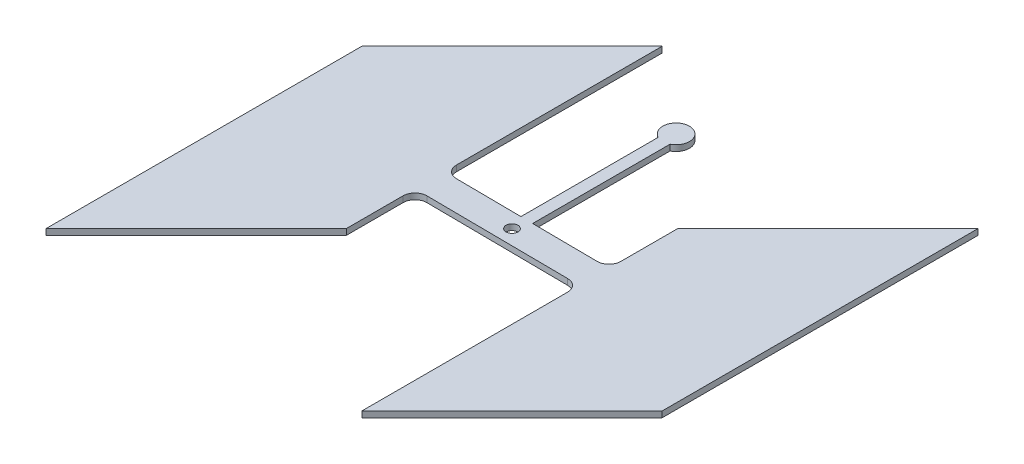
ISO-10303-21;
HEADER;
FILE_DESCRIPTION(('STEP AP214'),'2;1');
FILE_NAME('part.step','',(''),(''),'','','');
FILE_SCHEMA(('AUTOMOTIVE_DESIGN { 1 0 10303 214 1 1 1 1 }'));
ENDSEC;
DATA;
#1=APPLICATION_CONTEXT('core data for automotive mechanical design processes');
#2=APPLICATION_PROTOCOL_DEFINITION('international standard','automotive_design',2000,#1);
#3=PRODUCT_CONTEXT('',#1,'mechanical');
#4=PRODUCT('Part','Part','',(#3));
#5=PRODUCT_RELATED_PRODUCT_CATEGORY('part','',(#4));
#6=PRODUCT_DEFINITION_FORMATION('','',#4);
#7=PRODUCT_DEFINITION_CONTEXT('part definition',#1,'design');
#8=PRODUCT_DEFINITION('design','',#6,#7);
#9=PRODUCT_DEFINITION_SHAPE('','',#8);
#10=(LENGTH_UNIT() NAMED_UNIT(*) SI_UNIT(.MILLI.,.METRE.));
#11=(NAMED_UNIT(*) PLANE_ANGLE_UNIT() SI_UNIT($,.RADIAN.));
#12=(NAMED_UNIT(*) SI_UNIT($,.STERADIAN.) SOLID_ANGLE_UNIT());
#13=UNCERTAINTY_MEASURE_WITH_UNIT(LENGTH_MEASURE(1.E-05),#10,'distance_accuracy_value','');
#14=(GEOMETRIC_REPRESENTATION_CONTEXT(3) GLOBAL_UNCERTAINTY_ASSIGNED_CONTEXT((#13)) GLOBAL_UNIT_ASSIGNED_CONTEXT((#10,
#11,#12)) REPRESENTATION_CONTEXT('',''));
#15=CARTESIAN_POINT('',(0.,0.,0.));
#16=DIRECTION('',(0.,0.,1.));
#17=DIRECTION('',(1.,0.,0.));
#18=AXIS2_PLACEMENT_3D('',#15,#16,#17);
#19=CARTESIAN_POINT('',(-499.999999999996,12.7,4.16333634234426E-12));
#20=DIRECTION('',(1.,0.,0.));
#21=DIRECTION('',(0.,0.,-1.));
#22=AXIS2_PLACEMENT_3D('',#19,#20,#21);
#23=PLANE('',#22);
#24=DIRECTION('',(0.,0.,1.));
#25=VECTOR('',#24,1.);
#26=CARTESIAN_POINT('',(-499.999999999996,0.,4.16333634234426E-12));
#27=LINE('',#26,#25);
#28=CARTESIAN_POINT('',(-499.999999999997,0.,-177.7930007804));
#29=VERTEX_POINT('',#28);
#30=CARTESIAN_POINT('',(-499.999999999992,0.,500.00000000001));
#31=VERTEX_POINT('',#30);
#32=EDGE_CURVE('E271',#29,#31,#27,.T.);
#33=ORIENTED_EDGE('',*,*,#32,.T.);
#34=DIRECTION('',(0.,-1.,0.));
#35=VECTOR('',#34,1.);
#36=CARTESIAN_POINT('',(-499.999999999992,12.7,500.00000000001));
#37=LINE('',#36,#35);
#38=CARTESIAN_POINT('',(-499.999999999992,12.7,500.00000000001));
#39=VERTEX_POINT('',#38);
#40=EDGE_CURVE('E11',#39,#31,#37,.T.);
#41=ORIENTED_EDGE('',*,*,#40,.F.);
#42=DIRECTION('',(0.,0.,1.));
#43=VECTOR('',#42,1.);
#44=CARTESIAN_POINT('',(-499.999999999996,12.7,4.16333634234426E-12));
#45=LINE('',#44,#43);
#46=CARTESIAN_POINT('',(-499.999999999997,12.7,-177.7930007804));
#47=VERTEX_POINT('',#46);
#48=EDGE_CURVE('E211',#47,#39,#45,.T.);
#49=ORIENTED_EDGE('',*,*,#48,.F.);
#50=DIRECTION('',(0.,-1.,0.));
#51=VECTOR('',#50,1.);
#52=CARTESIAN_POINT('',(-499.999999999997,12.7,-177.7930007804));
#53=LINE('',#52,#51);
#54=EDGE_CURVE('E224',#47,#29,#53,.T.);
#55=ORIENTED_EDGE('',*,*,#54,.T.);
#56=EDGE_LOOP('',(#33,#41,#49,#55));
#57=FACE_BOUND('',#56,.T.);
#58=ADVANCED_FACE('F37',(#57),#23,.F.);
#59=CARTESIAN_POINT('',(2.74766180269664E-12,12.7,2.74766180269657E-12));
#60=DIRECTION('',(-0.707106781186557,0.,-0.707106781186538));
#61=DIRECTION('',(-0.707106781186538,0.,0.707106781186557));
#62=AXIS2_PLACEMENT_3D('',#59,#60,#61);
#63=PLANE('',#62);
#64=DIRECTION('',(0.707106781186538,0.,-0.707106781186557));
#65=VECTOR('',#64,1.);
#66=CARTESIAN_POINT('',(2.74766180269664E-12,0.,2.74766180269657E-12));
#67=LINE('',#66,#65);
#68=CARTESIAN_POINT('',(-177.793000780398,0.,177.793000780408));
#69=VERTEX_POINT('',#68);
#70=EDGE_CURVE('E266',#31,#69,#67,.T.);
#71=ORIENTED_EDGE('',*,*,#70,.T.);
#72=DIRECTION('',(0.,-1.,0.));
#73=VECTOR('',#72,1.);
#74=CARTESIAN_POINT('',(-177.793000780398,12.7,177.793000780408));
#75=LINE('',#74,#73);
#76=CARTESIAN_POINT('',(-177.793000780398,12.7,177.793000780408));
#77=VERTEX_POINT('',#76);
#78=EDGE_CURVE('E45',#77,#69,#75,.T.);
#79=ORIENTED_EDGE('',*,*,#78,.F.);
#80=DIRECTION('',(0.707106781186538,0.,-0.707106781186557));
#81=VECTOR('',#80,1.);
#82=CARTESIAN_POINT('',(2.74766180269664E-12,12.7,2.74766180269657E-12));
#83=LINE('',#82,#81);
#84=EDGE_CURVE('E128',#39,#77,#83,.T.);
#85=ORIENTED_EDGE('',*,*,#84,.F.);
#86=ORIENTED_EDGE('',*,*,#40,.T.);
#87=EDGE_LOOP('',(#71,#79,#85,#86));
#88=FACE_BOUND('',#87,.T.);
#89=ADVANCED_FACE('F267',(#88),#63,.F.);
#90=CARTESIAN_POINT('',(-177.793000780398,12.7,0.));
#91=DIRECTION('',(1.,0.,0.));
#92=DIRECTION('',(0.,0.,-1.));
#93=AXIS2_PLACEMENT_3D('',#90,#91,#92);
#94=PLANE('',#93);
#95=DIRECTION('',(0.,0.,1.));
#96=VECTOR('',#95,1.);
#97=CARTESIAN_POINT('',(-177.793000780398,0.,0.));
#98=LINE('',#97,#96);
#99=CARTESIAN_POINT('',(-177.793000780398,0.,55.7987661759797));
#100=VERTEX_POINT('',#99);
#101=EDGE_CURVE('E264',#100,#69,#98,.T.);
#102=ORIENTED_EDGE('',*,*,#101,.F.);
#103=DIRECTION('',(0.,-1.,0.));
#104=VECTOR('',#103,1.);
#105=CARTESIAN_POINT('',(-177.793000780398,12.7,55.7987661759797));
#106=LINE('',#105,#104);
#107=CARTESIAN_POINT('',(-177.793000780398,12.7,55.7987661759797));
#108=VERTEX_POINT('',#107);
#109=EDGE_CURVE('E259',#108,#100,#106,.T.);
#110=ORIENTED_EDGE('',*,*,#109,.F.);
#111=DIRECTION('',(0.,0.,1.));
#112=VECTOR('',#111,1.);
#113=CARTESIAN_POINT('',(-177.793000780398,12.7,0.));
#114=LINE('',#113,#112);
#115=EDGE_CURVE('E200',#108,#77,#114,.T.);
#116=ORIENTED_EDGE('',*,*,#115,.T.);
#117=ORIENTED_EDGE('',*,*,#78,.T.);
#118=EDGE_LOOP('',(#102,#110,#116,#117));
#119=FACE_BOUND('',#118,.T.);
#120=ADVANCED_FACE('F262',(#119),#94,.T.);
#121=CARTESIAN_POINT('',(-152.393000780439,12.7,55.7987661759797));
#122=DIRECTION('',(0.,-1.,0.));
#123=DIRECTION('',(0.,0.,-1.));
#124=AXIS2_PLACEMENT_3D('',#121,#122,#123);
#125=CYLINDRICAL_SURFACE('',#124,25.4);
#126=CARTESIAN_POINT('',(-152.393000780439,0.,55.7987661759797));
#127=DIRECTION('',(0.,1.,0.));
#128=DIRECTION('',(0.,0.,1.));
#129=AXIS2_PLACEMENT_3D('',#126,#127,#128);
#130=CIRCLE('',#129,25.4);
#131=CARTESIAN_POINT('',(-152.16762700973,0.,30.3997660644895));
#132=VERTEX_POINT('',#131);
#133=EDGE_CURVE('E276',#132,#100,#130,.T.);
#134=ORIENTED_EDGE('',*,*,#133,.F.);
#135=DIRECTION('',(0.,-1.,0.));
#136=VECTOR('',#135,1.);
#137=CARTESIAN_POINT('',(-152.16762700973,12.7,30.3997660644895));
#138=LINE('',#137,#136);
#139=CARTESIAN_POINT('',(-152.16762700973,12.7,30.3997660644895));
#140=VERTEX_POINT('',#139);
#141=EDGE_CURVE('E257',#140,#132,#138,.T.);
#142=ORIENTED_EDGE('',*,*,#141,.F.);
#143=CARTESIAN_POINT('',(-152.393000780439,12.7,55.7987661759797));
#144=DIRECTION('',(0.,1.,0.));
#145=DIRECTION('',(0.,0.,1.));
#146=AXIS2_PLACEMENT_3D('',#143,#144,#145);
#147=CIRCLE('',#146,25.4);
#148=EDGE_CURVE('E206',#140,#108,#147,.T.);
#149=ORIENTED_EDGE('',*,*,#148,.T.);
#150=ORIENTED_EDGE('',*,*,#109,.T.);
#151=EDGE_LOOP('',(#134,#142,#149,#150));
#152=FACE_BOUND('',#151,.T.);
#153=ADVANCED_FACE('F377',(#152),#125,.F.);
#154=CARTESIAN_POINT('',(-0.281706123395104,12.7,31.7475003279495));
#155=DIRECTION('',(0.00887298309880992,0.,-0.999960634310635));
#156=DIRECTION('',(-0.999960634310635,0.,-0.00887298309880992));
#157=AXIS2_PLACEMENT_3D('',#154,#155,#156);
#158=PLANE('',#157);
#159=DIRECTION('',(0.999960634310635,0.,0.00887298309880992));
#160=VECTOR('',#159,1.);
#161=CARTESIAN_POINT('',(-0.281706123395104,0.,31.7475003279495));
#162=LINE('',#161,#160);
#163=CARTESIAN_POINT('',(152.618374551146,0.,33.1042335683207));
#164=VERTEX_POINT('',#163);
#165=EDGE_CURVE('E278',#132,#164,#162,.T.);
#166=ORIENTED_EDGE('',*,*,#165,.T.);
#167=DIRECTION('',(0.,-1.,0.));
#168=VECTOR('',#167,1.);
#169=CARTESIAN_POINT('',(152.618374551146,12.7,33.1042335683207));
#170=LINE('',#169,#168);
#171=CARTESIAN_POINT('',(152.618374551146,12.7,33.1042335683207));
#172=VERTEX_POINT('',#171);
#173=EDGE_CURVE('E254',#172,#164,#170,.T.);
#174=ORIENTED_EDGE('',*,*,#173,.F.);
#175=DIRECTION('',(0.999960634310635,0.,0.00887298309880992));
#176=VECTOR('',#175,1.);
#177=CARTESIAN_POINT('',(-0.281706123395104,12.7,31.7475003279495));
#178=LINE('',#177,#176);
#179=EDGE_CURVE('E210',#140,#172,#178,.T.);
#180=ORIENTED_EDGE('',*,*,#179,.F.);
#181=ORIENTED_EDGE('',*,*,#141,.T.);
#182=EDGE_LOOP('',(#166,#174,#180,#181));
#183=FACE_BOUND('',#182,.T.);
#184=ADVANCED_FACE('F312',(#183),#158,.F.);
#185=CARTESIAN_POINT('',(152.393000780437,12.7,58.5032336798109));
#186=DIRECTION('',(0.,-1.,0.));
#187=DIRECTION('',(0.,0.,-1.));
#188=AXIS2_PLACEMENT_3D('',#185,#186,#187);
#189=CYLINDRICAL_SURFACE('',#188,25.4);
#190=CARTESIAN_POINT('',(152.393000780437,0.,58.5032336798109));
#191=DIRECTION('',(0.,1.,0.));
#192=DIRECTION('',(0.,0.,1.));
#193=AXIS2_PLACEMENT_3D('',#190,#191,#192);
#194=CIRCLE('',#193,25.4);
#195=CARTESIAN_POINT('',(177.793000780437,0.,58.5032336798109));
#196=VERTEX_POINT('',#195);
#197=EDGE_CURVE('E308',#164,#196,#194,.F.);
#198=ORIENTED_EDGE('',*,*,#197,.T.);
#199=DIRECTION('',(0.,-1.,0.));
#200=VECTOR('',#199,1.);
#201=CARTESIAN_POINT('',(177.793000780437,12.7,58.5032336798109));
#202=LINE('',#201,#200);
#203=CARTESIAN_POINT('',(177.793000780437,12.7,58.5032336798109));
#204=VERTEX_POINT('',#203);
#205=EDGE_CURVE('E251',#204,#196,#202,.T.);
#206=ORIENTED_EDGE('',*,*,#205,.F.);
#207=CARTESIAN_POINT('',(152.393000780437,12.7,58.5032336798109));
#208=DIRECTION('',(0.,1.,0.));
#209=DIRECTION('',(0.,0.,1.));
#210=AXIS2_PLACEMENT_3D('',#207,#208,#209);
#211=CIRCLE('',#210,25.4);
#212=EDGE_CURVE('E319',#172,#204,#211,.F.);
#213=ORIENTED_EDGE('',*,*,#212,.F.);
#214=ORIENTED_EDGE('',*,*,#173,.T.);
#215=EDGE_LOOP('',(#198,#206,#213,#214));
#216=FACE_BOUND('',#215,.T.);
#217=ADVANCED_FACE('F317',(#216),#189,.F.);
#218=CARTESIAN_POINT('',(177.793000780437,12.7,0.));
#219=DIRECTION('',(1.,0.,0.));
#220=DIRECTION('',(0.,0.,-1.));
#221=AXIS2_PLACEMENT_3D('',#218,#219,#220);
#222=PLANE('',#221);
#223=DIRECTION('',(0.,0.,1.));
#224=VECTOR('',#223,1.);
#225=CARTESIAN_POINT('',(177.793000780437,0.,0.));
#226=LINE('',#225,#224);
#227=CARTESIAN_POINT('',(177.793000780437,0.,500.000000000031));
#228=VERTEX_POINT('',#227);
#229=EDGE_CURVE('E306',#196,#228,#226,.T.);
#230=ORIENTED_EDGE('',*,*,#229,.T.);
#231=DIRECTION('',(0.,-1.,0.));
#232=VECTOR('',#231,1.);
#233=CARTESIAN_POINT('',(177.793000780437,12.7,500.000000000031));
#234=LINE('',#233,#232);
#235=CARTESIAN_POINT('',(177.793000780437,12.7,500.000000000031));
#236=VERTEX_POINT('',#235);
#237=EDGE_CURVE('E248',#236,#228,#234,.T.);
#238=ORIENTED_EDGE('',*,*,#237,.F.);
#239=DIRECTION('',(0.,0.,1.));
#240=VECTOR('',#239,1.);
#241=CARTESIAN_POINT('',(177.793000780437,12.7,0.));
#242=LINE('',#241,#240);
#243=EDGE_CURVE('E334',#204,#236,#242,.T.);
#244=ORIENTED_EDGE('',*,*,#243,.F.);
#245=ORIENTED_EDGE('',*,*,#205,.T.);
#246=EDGE_LOOP('',(#230,#238,#244,#245));
#247=FACE_BOUND('',#246,.T.);
#248=ADVANCED_FACE('F324',(#247),#222,.F.);
#249=CARTESIAN_POINT('',(338.896500390234,12.7,338.896500390234));
#250=DIRECTION('',(-0.707106781186548,0.,-0.707106781186548));
#251=DIRECTION('',(-0.707106781186548,0.,0.707106781186548));
#252=AXIS2_PLACEMENT_3D('',#249,#250,#251);
#253=PLANE('',#252);
#254=DIRECTION('',(0.707106781186548,0.,-0.707106781186548));
#255=VECTOR('',#254,1.);
#256=CARTESIAN_POINT('',(338.896500390234,0.,338.896500390234));
#257=LINE('',#256,#255);
#258=CARTESIAN_POINT('',(500.000000000051,0.,177.793000780417));
#259=VERTEX_POINT('',#258);
#260=EDGE_CURVE('E303',#228,#259,#257,.T.);
#261=ORIENTED_EDGE('',*,*,#260,.T.);
#262=DIRECTION('',(0.,-1.,0.));
#263=VECTOR('',#262,1.);
#264=CARTESIAN_POINT('',(500.000000000051,12.7,177.793000780417));
#265=LINE('',#264,#263);
#266=CARTESIAN_POINT('',(500.000000000051,12.7,177.793000780417));
#267=VERTEX_POINT('',#266);
#268=EDGE_CURVE('E246',#267,#259,#265,.T.);
#269=ORIENTED_EDGE('',*,*,#268,.F.);
#270=DIRECTION('',(0.707106781186548,0.,-0.707106781186548));
#271=VECTOR('',#270,1.);
#272=CARTESIAN_POINT('',(338.896500390234,12.7,338.896500390234));
#273=LINE('',#272,#271);
#274=EDGE_CURVE('E330',#236,#267,#273,.T.);
#275=ORIENTED_EDGE('',*,*,#274,.F.);
#276=ORIENTED_EDGE('',*,*,#237,.T.);
#277=EDGE_LOOP('',(#261,#269,#275,#276));
#278=FACE_BOUND('',#277,.T.);
#279=ADVANCED_FACE('F328',(#278),#253,.F.);
#280=CARTESIAN_POINT('',(500.000000000051,12.7,0.));
#281=DIRECTION('',(1.,0.,0.));
#282=DIRECTION('',(0.,0.,-1.));
#283=AXIS2_PLACEMENT_3D('',#280,#281,#282);
#284=PLANE('',#283);
#285=DIRECTION('',(0.,0.,1.));
#286=VECTOR('',#285,1.);
#287=CARTESIAN_POINT('',(500.000000000051,0.,0.));
#288=LINE('',#287,#286);
#289=CARTESIAN_POINT('',(500.000000000051,0.,-499.999999999983));
#290=VERTEX_POINT('',#289);
#291=EDGE_CURVE('E300',#290,#259,#288,.T.);
#292=ORIENTED_EDGE('',*,*,#291,.F.);
#293=DIRECTION('',(0.,-1.,0.));
#294=VECTOR('',#293,1.);
#295=CARTESIAN_POINT('',(500.000000000051,12.7,-499.999999999983));
#296=LINE('',#295,#294);
#297=CARTESIAN_POINT('',(500.000000000051,12.7,-499.999999999983));
#298=VERTEX_POINT('',#297);
#299=EDGE_CURVE('E244',#298,#290,#296,.T.);
#300=ORIENTED_EDGE('',*,*,#299,.F.);
#301=DIRECTION('',(0.,0.,1.));
#302=VECTOR('',#301,1.);
#303=CARTESIAN_POINT('',(500.000000000051,12.7,0.));
#304=LINE('',#303,#302);
#305=EDGE_CURVE('E333',#298,#267,#304,.T.);
#306=ORIENTED_EDGE('',*,*,#305,.T.);
#307=ORIENTED_EDGE('',*,*,#268,.T.);
#308=EDGE_LOOP('',(#292,#300,#306,#307));
#309=FACE_BOUND('',#308,.T.);
#310=ADVANCED_FACE('F388',(#309),#284,.T.);
#311=CARTESIAN_POINT('',(3.39925017305037E-11,12.7,3.39925017305037E-11));
#312=DIRECTION('',(0.707106781186548,0.,0.707106781186548));
#313=DIRECTION('',(0.707106781186548,0.,-0.707106781186548));
#314=AXIS2_PLACEMENT_3D('',#311,#312,#313);
#315=PLANE('',#314);
#316=DIRECTION('',(-0.707106781186548,0.,0.707106781186548));
#317=VECTOR('',#316,1.);
#318=CARTESIAN_POINT('',(3.39925017305037E-11,0.,3.39925017305037E-11));
#319=LINE('',#318,#317);
#320=CARTESIAN_POINT('',(177.793000780437,0.,-177.793000780369));
#321=VERTEX_POINT('',#320);
#322=EDGE_CURVE('E298',#290,#321,#319,.T.);
#323=ORIENTED_EDGE('',*,*,#322,.T.);
#324=DIRECTION('',(0.,-1.,0.));
#325=VECTOR('',#324,1.);
#326=CARTESIAN_POINT('',(177.793000780437,12.7,-177.793000780369));
#327=LINE('',#326,#325);
#328=CARTESIAN_POINT('',(177.793000780437,12.7,-177.793000780369));
#329=VERTEX_POINT('',#328);
#330=EDGE_CURVE('E241',#329,#321,#327,.T.);
#331=ORIENTED_EDGE('',*,*,#330,.F.);
#332=DIRECTION('',(-0.707106781186548,0.,0.707106781186548));
#333=VECTOR('',#332,1.);
#334=CARTESIAN_POINT('',(3.39925017305037E-11,12.7,3.39925017305037E-11));
#335=LINE('',#334,#333);
#336=EDGE_CURVE('E336',#298,#329,#335,.T.);
#337=ORIENTED_EDGE('',*,*,#336,.F.);
#338=ORIENTED_EDGE('',*,*,#299,.T.);
#339=EDGE_LOOP('',(#323,#331,#337,#338));
#340=FACE_BOUND('',#339,.T.);
#341=ADVANCED_FACE('F391',(#340),#315,.F.);
#342=CARTESIAN_POINT('',(177.793000780437,0.,-55.7987661759487));
#343=VERTEX_POINT('',#342);
#344=EDGE_CURVE('E297',#321,#343,#226,.T.);
#345=ORIENTED_EDGE('',*,*,#344,.T.);
#346=DIRECTION('',(0.,-1.,0.));
#347=VECTOR('',#346,1.);
#348=CARTESIAN_POINT('',(177.793000780437,12.7,-55.7987661759487));
#349=LINE('',#348,#347);
#350=CARTESIAN_POINT('',(177.793000780437,12.7,-55.7987661759487));
#351=VERTEX_POINT('',#350);
#352=EDGE_CURVE('E239',#351,#343,#349,.T.);
#353=ORIENTED_EDGE('',*,*,#352,.F.);
#354=EDGE_CURVE('E339',#329,#351,#242,.T.);
#355=ORIENTED_EDGE('',*,*,#354,.F.);
#356=ORIENTED_EDGE('',*,*,#330,.T.);
#357=EDGE_LOOP('',(#345,#353,#355,#356));
#358=FACE_BOUND('',#357,.T.);
#359=ADVANCED_FACE('F395',(#358),#222,.F.);
#360=CARTESIAN_POINT('',(152.393000780481,12.7,-55.7987661759487));
#361=DIRECTION('',(0.,-1.,0.));
#362=DIRECTION('',(0.,0.,-1.));
#363=AXIS2_PLACEMENT_3D('',#360,#361,#362);
#364=CYLINDRICAL_SURFACE('',#363,25.4);
#365=CARTESIAN_POINT('',(152.393000780481,0.,-55.7987661759487));
#366=DIRECTION('',(0.,1.,0.));
#367=DIRECTION('',(0.,0.,1.));
#368=AXIS2_PLACEMENT_3D('',#365,#366,#367);
#369=CIRCLE('',#368,25.4);
#370=CARTESIAN_POINT('',(152.167627009771,0.,-30.3997660644585));
#371=VERTEX_POINT('',#370);
#372=EDGE_CURVE('E294',#371,#343,#369,.T.);
#373=ORIENTED_EDGE('',*,*,#372,.F.);
#374=DIRECTION('',(0.,-1.,0.));
#375=VECTOR('',#374,1.);
#376=CARTESIAN_POINT('',(152.167627009771,12.7,-30.3997660644585));
#377=LINE('',#376,#375);
#378=CARTESIAN_POINT('',(152.167627009771,12.7,-30.3997660644585));
#379=VERTEX_POINT('',#378);
#380=EDGE_CURVE('E237',#379,#371,#377,.T.);
#381=ORIENTED_EDGE('',*,*,#380,.F.);
#382=CARTESIAN_POINT('',(152.393000780481,12.7,-55.7987661759487));
#383=DIRECTION('',(0.,1.,0.));
#384=DIRECTION('',(0.,0.,1.));
#385=AXIS2_PLACEMENT_3D('',#382,#383,#384);
#386=CIRCLE('',#385,25.4);
#387=EDGE_CURVE('E343',#379,#351,#386,.T.);
#388=ORIENTED_EDGE('',*,*,#387,.T.);
#389=ORIENTED_EDGE('',*,*,#352,.T.);
#390=EDGE_LOOP('',(#373,#381,#388,#389));
#391=FACE_BOUND('',#390,.T.);
#392=ADVANCED_FACE('F399',(#391),#364,.F.);
#393=CARTESIAN_POINT('',(0.28170612339484,12.7,-31.7475003279189));
#394=DIRECTION('',(0.00887298309881013,0.,-0.999960634310635));
#395=DIRECTION('',(-0.999960634310635,0.,-0.00887298309881013));
#396=AXIS2_PLACEMENT_3D('',#393,#394,#395);
#397=PLANE('',#396);
#398=DIRECTION('',(0.999960634310635,0.,0.00887298309881013));
#399=VECTOR('',#398,1.);
#400=CARTESIAN_POINT('',(0.28170612339484,0.,-31.7475003279189));
#401=LINE('',#400,#399);
#402=CARTESIAN_POINT('',(12.7116499254766,0.,-31.6372053048043));
#403=VERTEX_POINT('',#402);
#404=EDGE_CURVE('E284',#403,#371,#401,.T.);
#405=ORIENTED_EDGE('',*,*,#404,.F.);
#406=DIRECTION('',(0.,-1.,0.));
#407=VECTOR('',#406,1.);
#408=CARTESIAN_POINT('',(12.7116499254766,12.7,-31.6372053048043));
#409=LINE('',#408,#407);
#410=CARTESIAN_POINT('',(12.7116499254766,12.7,-31.6372053048043));
#411=VERTEX_POINT('',#410);
#412=EDGE_CURVE('E235',#411,#403,#409,.T.);
#413=ORIENTED_EDGE('',*,*,#412,.F.);
#414=DIRECTION('',(0.999960634310635,0.,0.00887298309881013));
#415=VECTOR('',#414,1.);
#416=CARTESIAN_POINT('',(0.28170612339484,12.7,-31.7475003279189));
#417=LINE('',#416,#415);
#418=EDGE_CURVE('E346',#411,#379,#417,.T.);
#419=ORIENTED_EDGE('',*,*,#418,.T.);
#420=ORIENTED_EDGE('',*,*,#380,.T.);
#421=EDGE_LOOP('',(#405,#413,#419,#420));
#422=FACE_BOUND('',#421,.T.);
#423=ADVANCED_FACE('F403',(#422),#397,.T.);
#424=CARTESIAN_POINT('',(12.7116499254765,12.7,0.));
#425=DIRECTION('',(1.,0.,0.));
#426=DIRECTION('',(0.,0.,-1.));
#427=AXIS2_PLACEMENT_3D('',#424,#425,#426);
#428=PLANE('',#427);
#429=DIRECTION('',(0.,0.,1.));
#430=VECTOR('',#429,1.);
#431=CARTESIAN_POINT('',(12.7116499254765,0.,0.));
#432=LINE('',#431,#430);
#433=CARTESIAN_POINT('',(12.7116499254765,0.,-326.507694892268));
#434=VERTEX_POINT('',#433);
#435=EDGE_CURVE('E290',#434,#403,#432,.T.);
#436=ORIENTED_EDGE('',*,*,#435,.F.);
#437=DIRECTION('',(0.,-1.,0.));
#438=VECTOR('',#437,1.);
#439=CARTESIAN_POINT('',(12.7116499254765,12.7,-326.507694892268));
#440=LINE('',#439,#438);
#441=CARTESIAN_POINT('',(12.7116499254765,12.7,-326.507694892268));
#442=VERTEX_POINT('',#441);
#443=EDGE_CURVE('E233',#442,#434,#440,.T.);
#444=ORIENTED_EDGE('',*,*,#443,.F.);
#445=DIRECTION('',(0.,0.,1.));
#446=VECTOR('',#445,1.);
#447=CARTESIAN_POINT('',(12.7116499254765,12.7,0.));
#448=LINE('',#447,#446);
#449=EDGE_CURVE('E349',#442,#411,#448,.T.);
#450=ORIENTED_EDGE('',*,*,#449,.T.);
#451=ORIENTED_EDGE('',*,*,#412,.T.);
#452=EDGE_LOOP('',(#436,#444,#450,#451));
#453=FACE_BOUND('',#452,.T.);
#454=ADVANCED_FACE('F405',(#453),#428,.T.);
#455=CARTESIAN_POINT('',(0.,12.7,-352.1380183196));
#456=DIRECTION('',(0.,-1.,0.));
#457=DIRECTION('',(0.,0.,-1.));
#458=AXIS2_PLACEMENT_3D('',#455,#456,#457);
#459=CYLINDRICAL_SURFACE('',#458,28.6094306622396);
#460=CARTESIAN_POINT('',(0.,0.,-352.1380183196));
#461=DIRECTION('',(0.,1.,0.));
#462=DIRECTION('',(0.,0.,1.));
#463=AXIS2_PLACEMENT_3D('',#460,#461,#462);
#464=CIRCLE('',#463,28.6094306622396);
#465=CARTESIAN_POINT('',(-12.7116499254765,0.,-326.507694892268));
#466=VERTEX_POINT('',#465);
#467=EDGE_CURVE('E288',#434,#466,#464,.T.);
#468=ORIENTED_EDGE('',*,*,#467,.T.);
#469=DIRECTION('',(0.,-1.,0.));
#470=VECTOR('',#469,1.);
#471=CARTESIAN_POINT('',(-12.7116499254765,12.7,-326.507694892268));
#472=LINE('',#471,#470);
#473=CARTESIAN_POINT('',(-12.7116499254765,12.7,-326.507694892268));
#474=VERTEX_POINT('',#473);
#475=EDGE_CURVE('E230',#474,#466,#472,.T.);
#476=ORIENTED_EDGE('',*,*,#475,.F.);
#477=CARTESIAN_POINT('',(0.,12.7,-352.1380183196));
#478=DIRECTION('',(0.,1.,0.));
#479=DIRECTION('',(0.,0.,1.));
#480=AXIS2_PLACEMENT_3D('',#477,#478,#479);
#481=CIRCLE('',#480,28.6094306622396);
#482=EDGE_CURVE('E352',#442,#474,#481,.T.);
#483=ORIENTED_EDGE('',*,*,#482,.F.);
#484=ORIENTED_EDGE('',*,*,#443,.T.);
#485=EDGE_LOOP('',(#468,#476,#483,#484));
#486=FACE_BOUND('',#485,.T.);
#487=ADVANCED_FACE('F408',(#486),#459,.T.);
#488=CARTESIAN_POINT('',(-12.7116499254765,12.7,0.));
#489=DIRECTION('',(1.,0.,0.));
#490=DIRECTION('',(0.,0.,-1.));
#491=AXIS2_PLACEMENT_3D('',#488,#489,#490);
#492=PLANE('',#491);
#493=DIRECTION('',(0.,0.,1.));
#494=VECTOR('',#493,1.);
#495=CARTESIAN_POINT('',(-12.7116499254765,0.,0.));
#496=LINE('',#495,#494);
#497=CARTESIAN_POINT('',(-12.7116499254766,0.,-31.8627946951796));
#498=VERTEX_POINT('',#497);
#499=EDGE_CURVE('E282',#466,#498,#496,.T.);
#500=ORIENTED_EDGE('',*,*,#499,.T.);
#501=DIRECTION('',(0.,-1.,0.));
#502=VECTOR('',#501,1.);
#503=CARTESIAN_POINT('',(-12.7116499254766,12.7,-31.8627946951796));
#504=LINE('',#503,#502);
#505=CARTESIAN_POINT('',(-12.7116499254766,12.7,-31.8627946951796));
#506=VERTEX_POINT('',#505);
#507=EDGE_CURVE('E228',#506,#498,#504,.T.);
#508=ORIENTED_EDGE('',*,*,#507,.F.);
#509=DIRECTION('',(0.,0.,1.));
#510=VECTOR('',#509,1.);
#511=CARTESIAN_POINT('',(-12.7116499254765,12.7,0.));
#512=LINE('',#511,#510);
#513=EDGE_CURVE('E354',#474,#506,#512,.T.);
#514=ORIENTED_EDGE('',*,*,#513,.F.);
#515=ORIENTED_EDGE('',*,*,#475,.T.);
#516=EDGE_LOOP('',(#500,#508,#514,#515));
#517=FACE_BOUND('',#516,.T.);
#518=ADVANCED_FACE('F412',(#517),#492,.F.);
#519=CARTESIAN_POINT('',(-152.618374551107,0.,-33.1042335682898));
#520=VERTEX_POINT('',#519);
#521=EDGE_CURVE('E280',#520,#498,#401,.T.);
#522=ORIENTED_EDGE('',*,*,#521,.F.);
#523=DIRECTION('',(0.,-1.,0.));
#524=VECTOR('',#523,1.);
#525=CARTESIAN_POINT('',(-152.618374551107,12.7,-33.1042335682898));
#526=LINE('',#525,#524);
#527=CARTESIAN_POINT('',(-152.618374551107,12.7,-33.1042335682898));
#528=VERTEX_POINT('',#527);
#529=EDGE_CURVE('E196',#528,#520,#526,.T.);
#530=ORIENTED_EDGE('',*,*,#529,.F.);
#531=EDGE_CURVE('E185',#528,#506,#417,.T.);
#532=ORIENTED_EDGE('',*,*,#531,.T.);
#533=ORIENTED_EDGE('',*,*,#507,.T.);
#534=EDGE_LOOP('',(#522,#530,#532,#533));
#535=FACE_BOUND('',#534,.T.);
#536=ADVANCED_FACE('F416',(#535),#397,.T.);
#537=CARTESIAN_POINT('',(-152.393000780398,12.7,-58.5032336797799));
#538=DIRECTION('',(0.,-1.,0.));
#539=DIRECTION('',(0.,0.,-1.));
#540=AXIS2_PLACEMENT_3D('',#537,#538,#539);
#541=CYLINDRICAL_SURFACE('',#540,25.4);
#542=CARTESIAN_POINT('',(-152.393000780398,0.,-58.5032336797799));
#543=DIRECTION('',(0.,1.,0.));
#544=DIRECTION('',(0.,0.,1.));
#545=AXIS2_PLACEMENT_3D('',#542,#543,#544);
#546=CIRCLE('',#545,25.4);
#547=CARTESIAN_POINT('',(-177.793000780398,0.,-58.5032336797799));
#548=VERTEX_POINT('',#547);
#549=EDGE_CURVE('E192',#520,#548,#546,.F.);
#550=ORIENTED_EDGE('',*,*,#549,.T.);
#551=DIRECTION('',(0.,-1.,0.));
#552=VECTOR('',#551,1.);
#553=CARTESIAN_POINT('',(-177.793000780398,12.7,-58.5032336797799));
#554=LINE('',#553,#552);
#555=CARTESIAN_POINT('',(-177.793000780398,12.7,-58.5032336797799));
#556=VERTEX_POINT('',#555);
#557=EDGE_CURVE('E189',#556,#548,#554,.T.);
#558=ORIENTED_EDGE('',*,*,#557,.F.);
#559=CARTESIAN_POINT('',(-152.393000780398,12.7,-58.5032336797799));
#560=DIRECTION('',(0.,1.,0.));
#561=DIRECTION('',(0.,0.,1.));
#562=AXIS2_PLACEMENT_3D('',#559,#560,#561);
#563=CIRCLE('',#562,25.4);
#564=EDGE_CURVE('E178',#528,#556,#563,.F.);
#565=ORIENTED_EDGE('',*,*,#564,.F.);
#566=ORIENTED_EDGE('',*,*,#529,.T.);
#567=EDGE_LOOP('',(#550,#558,#565,#566));
#568=FACE_BOUND('',#567,.T.);
#569=ADVANCED_FACE('F190',(#568),#541,.F.);
#570=CARTESIAN_POINT('',(-177.793000780398,0.,-500.));
#571=VERTEX_POINT('',#570);
#572=EDGE_CURVE('E220',#571,#548,#98,.T.);
#573=ORIENTED_EDGE('',*,*,#572,.F.);
#574=DIRECTION('',(0.,-1.,0.));
#575=VECTOR('',#574,1.);
#576=CARTESIAN_POINT('',(-177.793000780398,12.7,-500.));
#577=LINE('',#576,#575);
#578=CARTESIAN_POINT('',(-177.793000780398,12.7,-500.));
#579=VERTEX_POINT('',#578);
#580=EDGE_CURVE('E117',#579,#571,#577,.T.);
#581=ORIENTED_EDGE('',*,*,#580,.F.);
#582=EDGE_CURVE('E183',#579,#556,#114,.T.);
#583=ORIENTED_EDGE('',*,*,#582,.T.);
#584=ORIENTED_EDGE('',*,*,#557,.T.);
#585=EDGE_LOOP('',(#573,#581,#583,#584));
#586=FACE_BOUND('',#585,.T.);
#587=ADVANCED_FACE('F198',(#586),#94,.T.);
#588=CARTESIAN_POINT('',(-338.896500390199,12.7,-338.896500390199));
#589=DIRECTION('',(0.707106781186548,0.,0.707106781186548));
#590=DIRECTION('',(0.707106781186548,0.,-0.707106781186548));
#591=AXIS2_PLACEMENT_3D('',#588,#589,#590);
#592=PLANE('',#591);
#593=DIRECTION('',(-0.707106781186548,0.,0.707106781186548));
#594=VECTOR('',#593,1.);
#595=CARTESIAN_POINT('',(-338.896500390199,0.,-338.896500390199));
#596=LINE('',#595,#594);
#597=EDGE_CURVE('E120',#571,#29,#596,.T.);
#598=ORIENTED_EDGE('',*,*,#597,.T.);
#599=ORIENTED_EDGE('',*,*,#54,.F.);
#600=DIRECTION('',(-0.707106781186548,0.,0.707106781186548));
#601=VECTOR('',#600,1.);
#602=CARTESIAN_POINT('',(-338.896500390199,12.7,-338.896500390199));
#603=LINE('',#602,#601);
#604=EDGE_CURVE('E53',#579,#47,#603,.T.);
#605=ORIENTED_EDGE('',*,*,#604,.F.);
#606=ORIENTED_EDGE('',*,*,#580,.T.);
#607=EDGE_LOOP('',(#598,#599,#605,#606));
#608=FACE_BOUND('',#607,.T.);
#609=ADVANCED_FACE('F359',(#608),#592,.F.);
#610=CARTESIAN_POINT('',(0.,12.7,0.));
#611=DIRECTION('',(0.,-1.,0.));
#612=DIRECTION('',(0.,0.,-1.));
#613=AXIS2_PLACEMENT_3D('',#610,#611,#612);
#614=CYLINDRICAL_SURFACE('',#613,12.7);
#615=CARTESIAN_POINT('',(0.,12.7,0.));
#616=DIRECTION('',(0.,1.,0.));
#617=DIRECTION('',(0.,0.,1.));
#618=AXIS2_PLACEMENT_3D('',#615,#616,#617);
#619=CIRCLE('',#618,12.7);
#620=CARTESIAN_POINT('',(0.,12.7,12.7));
#621=VERTEX_POINT('',#620);
#622=EDGE_CURVE('E201',#621,#621,#619,.T.);
#623=ORIENTED_EDGE('',*,*,#622,.T.);
#624=EDGE_LOOP('',(#623));
#625=FACE_BOUND('',#624,.T.);
#626=CARTESIAN_POINT('',(0.,0.,0.));
#627=DIRECTION('',(0.,1.,0.));
#628=DIRECTION('',(0.,0.,1.));
#629=AXIS2_PLACEMENT_3D('',#626,#627,#628);
#630=CIRCLE('',#629,12.7);
#631=CARTESIAN_POINT('',(0.,0.,12.7));
#632=VERTEX_POINT('',#631);
#633=EDGE_CURVE('E212',#632,#632,#630,.T.);
#634=ORIENTED_EDGE('',*,*,#633,.F.);
#635=EDGE_LOOP('',(#634));
#636=FACE_BOUND('',#635,.T.);
#637=ADVANCED_FACE('F361',(#625,#636),#614,.F.);
#638=CARTESIAN_POINT('',(0.,12.7,0.));
#639=DIRECTION('',(0.,1.,0.));
#640=DIRECTION('',(0.,0.,1.));
#641=AXIS2_PLACEMENT_3D('',#638,#639,#640);
#642=PLANE('',#641);
#643=ORIENTED_EDGE('',*,*,#48,.T.);
#644=ORIENTED_EDGE('',*,*,#84,.T.);
#645=ORIENTED_EDGE('',*,*,#115,.F.);
#646=ORIENTED_EDGE('',*,*,#148,.F.);
#647=ORIENTED_EDGE('',*,*,#179,.T.);
#648=ORIENTED_EDGE('',*,*,#212,.T.);
#649=ORIENTED_EDGE('',*,*,#243,.T.);
#650=ORIENTED_EDGE('',*,*,#274,.T.);
#651=ORIENTED_EDGE('',*,*,#305,.F.);
#652=ORIENTED_EDGE('',*,*,#336,.T.);
#653=ORIENTED_EDGE('',*,*,#354,.T.);
#654=ORIENTED_EDGE('',*,*,#387,.F.);
#655=ORIENTED_EDGE('',*,*,#418,.F.);
#656=ORIENTED_EDGE('',*,*,#449,.F.);
#657=ORIENTED_EDGE('',*,*,#482,.T.);
#658=ORIENTED_EDGE('',*,*,#513,.T.);
#659=ORIENTED_EDGE('',*,*,#531,.F.);
#660=ORIENTED_EDGE('',*,*,#564,.T.);
#661=ORIENTED_EDGE('',*,*,#582,.F.);
#662=ORIENTED_EDGE('',*,*,#604,.T.);
#663=EDGE_LOOP('',(#643,#644,#645,#646,#647,#648,#649,#650,#651,#652,#653,#654,#655,#656,#657,
#658,#659,#660,#661,#662));
#664=FACE_BOUND('',#663,.T.);
#665=ORIENTED_EDGE('',*,*,#622,.F.);
#666=EDGE_LOOP('',(#665));
#667=FACE_BOUND('',#666,.T.);
#668=ADVANCED_FACE('F180',(#664,#667),#642,.T.);
#669=CARTESIAN_POINT('',(0.,0.,0.));
#670=DIRECTION('',(0.,1.,0.));
#671=DIRECTION('',(0.,0.,1.));
#672=AXIS2_PLACEMENT_3D('',#669,#670,#671);
#673=PLANE('',#672);
#674=ORIENTED_EDGE('',*,*,#32,.F.);
#675=ORIENTED_EDGE('',*,*,#597,.F.);
#676=ORIENTED_EDGE('',*,*,#572,.T.);
#677=ORIENTED_EDGE('',*,*,#549,.F.);
#678=ORIENTED_EDGE('',*,*,#521,.T.);
#679=ORIENTED_EDGE('',*,*,#499,.F.);
#680=ORIENTED_EDGE('',*,*,#467,.F.);
#681=ORIENTED_EDGE('',*,*,#435,.T.);
#682=ORIENTED_EDGE('',*,*,#404,.T.);
#683=ORIENTED_EDGE('',*,*,#372,.T.);
#684=ORIENTED_EDGE('',*,*,#344,.F.);
#685=ORIENTED_EDGE('',*,*,#322,.F.);
#686=ORIENTED_EDGE('',*,*,#291,.T.);
#687=ORIENTED_EDGE('',*,*,#260,.F.);
#688=ORIENTED_EDGE('',*,*,#229,.F.);
#689=ORIENTED_EDGE('',*,*,#197,.F.);
#690=ORIENTED_EDGE('',*,*,#165,.F.);
#691=ORIENTED_EDGE('',*,*,#133,.T.);
#692=ORIENTED_EDGE('',*,*,#101,.T.);
#693=ORIENTED_EDGE('',*,*,#70,.F.);
#694=EDGE_LOOP('',(#674,#675,#676,#677,#678,#679,#680,#681,#682,#683,#684,#685,#686,#687,#688,
#689,#690,#691,#692,#693));
#695=FACE_BOUND('',#694,.T.);
#696=ORIENTED_EDGE('',*,*,#633,.T.);
#697=EDGE_LOOP('',(#696));
#698=FACE_BOUND('',#697,.T.);
#699=ADVANCED_FACE('F273',(#695,#698),#673,.F.);
#700=CLOSED_SHELL('',(#58,#89,#120,#153,#184,#217,#248,#279,#310,#341,#359,#392,#423,#454,#487,
#518,#536,#569,#587,#609,#637,#668,#699));
#701=MANIFOLD_SOLID_BREP('B2',#700);
#702=ADVANCED_BREP_SHAPE_REPRESENTATION('',(#18,#701),#14);
#703=SHAPE_DEFINITION_REPRESENTATION(#9,#702);
ENDSEC;
END-ISO-10303-21;
